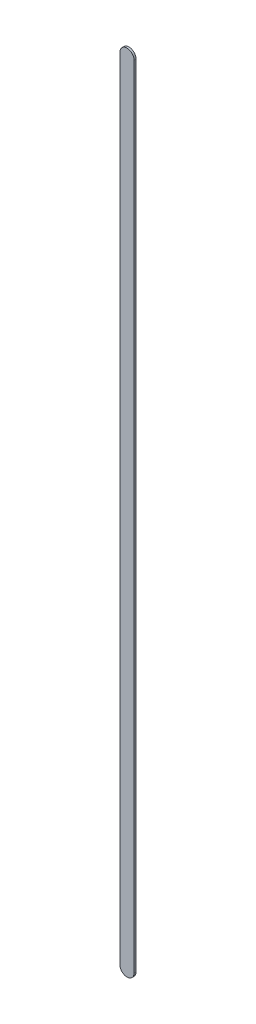
ISO-10303-21;
HEADER;
FILE_DESCRIPTION(('STEP AP214'),'2;1');
FILE_NAME('part.step','',(''),(''),'','','');
FILE_SCHEMA(('AUTOMOTIVE_DESIGN { 1 0 10303 214 1 1 1 1 }'));
ENDSEC;
DATA;
#1=APPLICATION_CONTEXT('core data for automotive mechanical design processes');
#2=APPLICATION_PROTOCOL_DEFINITION('international standard','automotive_design',2000,#1);
#3=PRODUCT_CONTEXT('',#1,'mechanical');
#4=PRODUCT('Part','Part','',(#3));
#5=PRODUCT_RELATED_PRODUCT_CATEGORY('part','',(#4));
#6=PRODUCT_DEFINITION_FORMATION('','',#4);
#7=PRODUCT_DEFINITION_CONTEXT('part definition',#1,'design');
#8=PRODUCT_DEFINITION('design','',#6,#7);
#9=PRODUCT_DEFINITION_SHAPE('','',#8);
#10=(LENGTH_UNIT() NAMED_UNIT(*) SI_UNIT(.MILLI.,.METRE.));
#11=(NAMED_UNIT(*) PLANE_ANGLE_UNIT() SI_UNIT($,.RADIAN.));
#12=(NAMED_UNIT(*) SI_UNIT($,.STERADIAN.) SOLID_ANGLE_UNIT());
#13=UNCERTAINTY_MEASURE_WITH_UNIT(LENGTH_MEASURE(1.E-05),#10,'distance_accuracy_value','');
#14=(GEOMETRIC_REPRESENTATION_CONTEXT(3) GLOBAL_UNCERTAINTY_ASSIGNED_CONTEXT((#13)) GLOBAL_UNIT_ASSIGNED_CONTEXT((#10,
#11,#12)) REPRESENTATION_CONTEXT('',''));
#15=CARTESIAN_POINT('',(0.,0.,0.));
#16=DIRECTION('',(0.,0.,1.));
#17=DIRECTION('',(1.,0.,0.));
#18=AXIS2_PLACEMENT_3D('',#15,#16,#17);
#19=CARTESIAN_POINT('',(102.84397262,87.4869726,0.));
#20=DIRECTION('',(-1.,0.,0.));
#21=DIRECTION('',(0.,1.,0.));
#22=AXIS2_PLACEMENT_3D('',#19,#20,#21);
#23=PLANE('',#22);
#24=DIRECTION('',(0.,1.,0.));
#25=VECTOR('',#24,1.);
#26=CARTESIAN_POINT('',(102.84397262,87.4869726,0.03556));
#27=LINE('',#26,#25);
#28=CARTESIAN_POINT('',(102.84397262,87.4869726,0.03556));
#29=VERTEX_POINT('',#28);
#30=CARTESIAN_POINT('',(102.84397262,101.68697214,0.03556));
#31=VERTEX_POINT('',#30);
#32=EDGE_CURVE('E11',#29,#31,#27,.T.);
#33=ORIENTED_EDGE('',*,*,#32,.F.);
#34=DIRECTION('',(0.,0.,1.));
#35=VECTOR('',#34,1.);
#36=CARTESIAN_POINT('',(102.84397262,87.4869726,0.));
#37=LINE('',#36,#35);
#38=CARTESIAN_POINT('',(102.84397262,87.4869726,0.));
#39=VERTEX_POINT('',#38);
#40=EDGE_CURVE('E24',#39,#29,#37,.T.);
#41=ORIENTED_EDGE('',*,*,#40,.F.);
#42=DIRECTION('',(0.,1.,0.));
#43=VECTOR('',#42,1.);
#44=CARTESIAN_POINT('',(102.84397262,87.4869726,0.));
#45=LINE('',#44,#43);
#46=CARTESIAN_POINT('',(102.84397262,101.68697214,0.));
#47=VERTEX_POINT('',#46);
#48=EDGE_CURVE('E75',#39,#47,#45,.T.);
#49=ORIENTED_EDGE('',*,*,#48,.T.);
#50=DIRECTION('',(0.,0.,1.));
#51=VECTOR('',#50,1.);
#52=CARTESIAN_POINT('',(102.84397262,101.68697214,0.));
#53=LINE('',#52,#51);
#54=EDGE_CURVE('E37',#47,#31,#53,.T.);
#55=ORIENTED_EDGE('',*,*,#54,.T.);
#56=EDGE_LOOP('',(#33,#41,#49,#55));
#57=FACE_BOUND('',#56,.T.);
#58=ADVANCED_FACE('F17',(#57),#23,.F.);
#59=CARTESIAN_POINT('',(102.71697262,101.68697214,0.));
#60=DIRECTION('',(0.,0.,-1.));
#61=DIRECTION('',(1.,-1.11896493820492E-13,0.));
#62=AXIS2_PLACEMENT_3D('',#59,#60,#61);
#63=CYLINDRICAL_SURFACE('',#62,0.126999999999991);
#64=CARTESIAN_POINT('',(102.71697262,101.68697214,0.03556));
#65=DIRECTION('',(0.,0.,1.));
#66=DIRECTION('',(1.,-1.11896493820492E-13,0.));
#67=AXIS2_PLACEMENT_3D('',#64,#65,#66);
#68=CIRCLE('',#67,0.126999999999991);
#69=CARTESIAN_POINT('',(102.58997262,101.68697214,0.03556));
#70=VERTEX_POINT('',#69);
#71=EDGE_CURVE('E83',#31,#70,#68,.T.);
#72=ORIENTED_EDGE('',*,*,#71,.F.);
#73=ORIENTED_EDGE('',*,*,#54,.F.);
#74=CARTESIAN_POINT('',(102.71697262,101.68697214,0.));
#75=DIRECTION('',(0.,0.,1.));
#76=DIRECTION('',(1.,-1.11896493820492E-13,0.));
#77=AXIS2_PLACEMENT_3D('',#74,#75,#76);
#78=CIRCLE('',#77,0.126999999999991);
#79=CARTESIAN_POINT('',(102.58997262,101.68697214,0.));
#80=VERTEX_POINT('',#79);
#81=EDGE_CURVE('E81',#47,#80,#78,.T.);
#82=ORIENTED_EDGE('',*,*,#81,.T.);
#83=DIRECTION('',(0.,0.,1.));
#84=VECTOR('',#83,1.);
#85=CARTESIAN_POINT('',(102.58997262,101.68697214,0.));
#86=LINE('',#85,#84);
#87=EDGE_CURVE('E67',#80,#70,#86,.T.);
#88=ORIENTED_EDGE('',*,*,#87,.T.);
#89=EDGE_LOOP('',(#72,#73,#82,#88));
#90=FACE_BOUND('',#89,.T.);
#91=ADVANCED_FACE('F89',(#90),#63,.T.);
#92=CARTESIAN_POINT('',(102.58997262,101.68697214,0.));
#93=DIRECTION('',(1.,0.,0.));
#94=DIRECTION('',(0.,-1.,0.));
#95=AXIS2_PLACEMENT_3D('',#92,#93,#94);
#96=PLANE('',#95);
#97=DIRECTION('',(0.,-1.,0.));
#98=VECTOR('',#97,1.);
#99=CARTESIAN_POINT('',(102.58997262,101.68697214,0.03556));
#100=LINE('',#99,#98);
#101=CARTESIAN_POINT('',(102.58997262,87.4869726,0.03556));
#102=VERTEX_POINT('',#101);
#103=EDGE_CURVE('E71',#70,#102,#100,.T.);
#104=ORIENTED_EDGE('',*,*,#103,.F.);
#105=ORIENTED_EDGE('',*,*,#87,.F.);
#106=DIRECTION('',(0.,-1.,0.));
#107=VECTOR('',#106,1.);
#108=CARTESIAN_POINT('',(102.58997262,101.68697214,0.));
#109=LINE('',#108,#107);
#110=CARTESIAN_POINT('',(102.58997262,87.4869726,0.));
#111=VERTEX_POINT('',#110);
#112=EDGE_CURVE('E63',#80,#111,#109,.T.);
#113=ORIENTED_EDGE('',*,*,#112,.T.);
#114=DIRECTION('',(0.,0.,1.));
#115=VECTOR('',#114,1.);
#116=CARTESIAN_POINT('',(102.58997262,87.4869726,0.));
#117=LINE('',#116,#115);
#118=EDGE_CURVE('E53',#111,#102,#117,.T.);
#119=ORIENTED_EDGE('',*,*,#118,.T.);
#120=EDGE_LOOP('',(#104,#105,#113,#119));
#121=FACE_BOUND('',#120,.T.);
#122=ADVANCED_FACE('F66',(#121),#96,.F.);
#123=CARTESIAN_POINT('',(102.71697262,87.4869726,0.));
#124=DIRECTION('',(0.,0.,-1.));
#125=DIRECTION('',(-1.,0.,0.));
#126=AXIS2_PLACEMENT_3D('',#123,#124,#125);
#127=CYLINDRICAL_SURFACE('',#126,0.126999999999995);
#128=CARTESIAN_POINT('',(102.71697262,87.4869726,0.03556));
#129=DIRECTION('',(0.,0.,1.));
#130=DIRECTION('',(-1.,0.,0.));
#131=AXIS2_PLACEMENT_3D('',#128,#129,#130);
#132=CIRCLE('',#131,0.126999999999995);
#133=EDGE_CURVE('E59',#102,#29,#132,.T.);
#134=ORIENTED_EDGE('',*,*,#133,.F.);
#135=ORIENTED_EDGE('',*,*,#118,.F.);
#136=CARTESIAN_POINT('',(102.71697262,87.4869726,0.));
#137=DIRECTION('',(0.,0.,1.));
#138=DIRECTION('',(-1.,0.,0.));
#139=AXIS2_PLACEMENT_3D('',#136,#137,#138);
#140=CIRCLE('',#139,0.126999999999995);
#141=EDGE_CURVE('E57',#111,#39,#140,.T.);
#142=ORIENTED_EDGE('',*,*,#141,.T.);
#143=ORIENTED_EDGE('',*,*,#40,.T.);
#144=EDGE_LOOP('',(#134,#135,#142,#143));
#145=FACE_BOUND('',#144,.T.);
#146=ADVANCED_FACE('F55',(#145),#127,.T.);
#147=CARTESIAN_POINT('',(102.84397262,87.4869726,0.));
#148=DIRECTION('',(0.,0.,-1.));
#149=DIRECTION('',(-1.,0.,0.));
#150=AXIS2_PLACEMENT_3D('',#147,#148,#149);
#151=PLANE('',#150);
#152=ORIENTED_EDGE('',*,*,#141,.F.);
#153=ORIENTED_EDGE('',*,*,#112,.F.);
#154=ORIENTED_EDGE('',*,*,#81,.F.);
#155=ORIENTED_EDGE('',*,*,#48,.F.);
#156=EDGE_LOOP('',(#152,#153,#154,#155));
#157=FACE_BOUND('',#156,.T.);
#158=ADVANCED_FACE('F74',(#157),#151,.T.);
#159=CARTESIAN_POINT('',(102.84397262,87.4869726,0.03556));
#160=DIRECTION('',(0.,0.,-1.));
#161=DIRECTION('',(-1.,0.,0.));
#162=AXIS2_PLACEMENT_3D('',#159,#160,#161);
#163=PLANE('',#162);
#164=ORIENTED_EDGE('',*,*,#32,.T.);
#165=ORIENTED_EDGE('',*,*,#71,.T.);
#166=ORIENTED_EDGE('',*,*,#103,.T.);
#167=ORIENTED_EDGE('',*,*,#133,.T.);
#168=EDGE_LOOP('',(#164,#165,#166,#167));
#169=FACE_BOUND('',#168,.T.);
#170=ADVANCED_FACE('F91',(#169),#163,.F.);
#171=CLOSED_SHELL('',(#58,#91,#122,#146,#158,#170));
#172=MANIFOLD_SOLID_BREP('B1',#171);
#173=ADVANCED_BREP_SHAPE_REPRESENTATION('',(#18,#172),#14);
#174=SHAPE_DEFINITION_REPRESENTATION(#9,#173);
ENDSEC;
END-ISO-10303-21;
